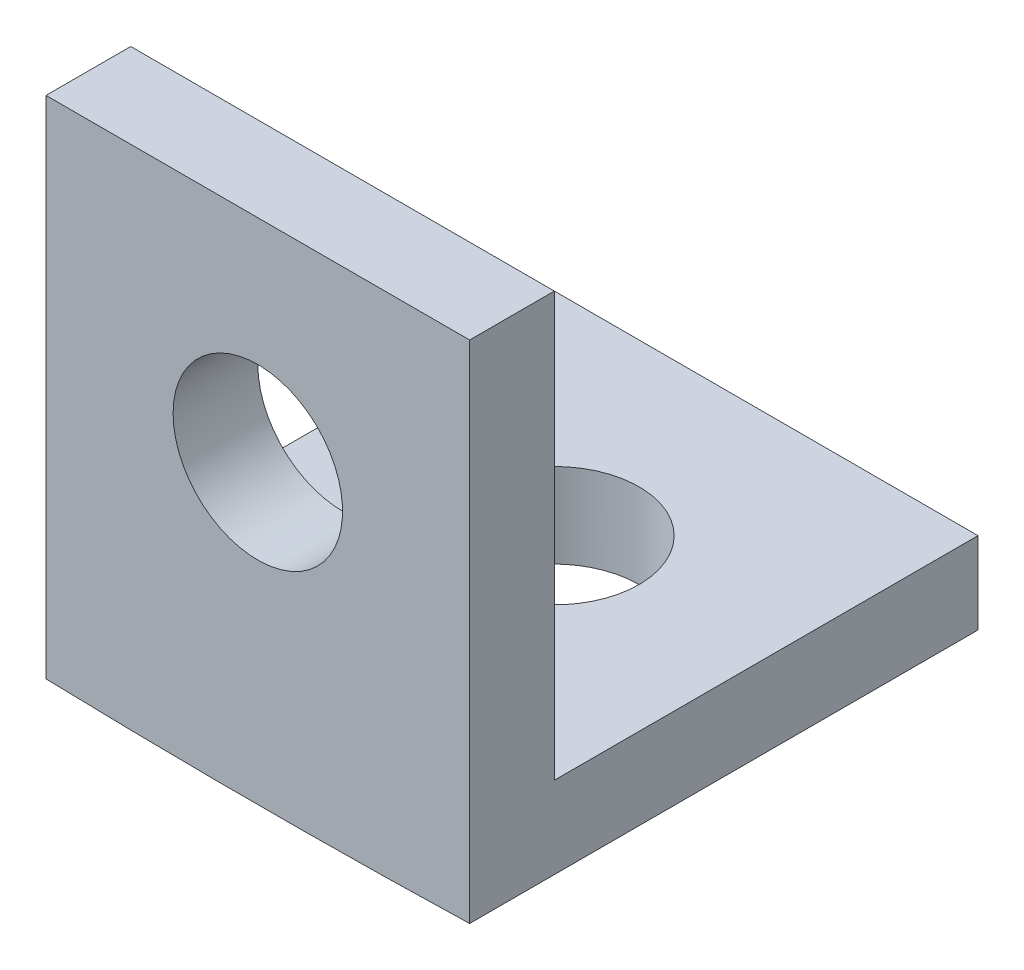
ISO-10303-21;
HEADER;
FILE_DESCRIPTION(('STEP AP214'),'2;1');
FILE_NAME('part.step','',(''),(''),'','','');
FILE_SCHEMA(('AUTOMOTIVE_DESIGN { 1 0 10303 214 1 1 1 1 }'));
ENDSEC;
DATA;
#1=APPLICATION_CONTEXT('core data for automotive mechanical design processes');
#2=APPLICATION_PROTOCOL_DEFINITION('international standard','automotive_design',2000,#1);
#3=PRODUCT_CONTEXT('',#1,'mechanical');
#4=PRODUCT('Part','Part','',(#3));
#5=PRODUCT_RELATED_PRODUCT_CATEGORY('part','',(#4));
#6=PRODUCT_DEFINITION_FORMATION('','',#4);
#7=PRODUCT_DEFINITION_CONTEXT('part definition',#1,'design');
#8=PRODUCT_DEFINITION('design','',#6,#7);
#9=PRODUCT_DEFINITION_SHAPE('','',#8);
#10=(LENGTH_UNIT() NAMED_UNIT(*) SI_UNIT(.MILLI.,.METRE.));
#11=(NAMED_UNIT(*) PLANE_ANGLE_UNIT() SI_UNIT($,.RADIAN.));
#12=(NAMED_UNIT(*) SI_UNIT($,.STERADIAN.) SOLID_ANGLE_UNIT());
#13=UNCERTAINTY_MEASURE_WITH_UNIT(LENGTH_MEASURE(1.E-05),#10,'distance_accuracy_value','');
#14=(GEOMETRIC_REPRESENTATION_CONTEXT(3) GLOBAL_UNCERTAINTY_ASSIGNED_CONTEXT((#13)) GLOBAL_UNIT_ASSIGNED_CONTEXT((#10,
#11,#12)) REPRESENTATION_CONTEXT('',''));
#15=CARTESIAN_POINT('',(0.,0.,0.));
#16=DIRECTION('',(0.,0.,1.));
#17=DIRECTION('',(1.,0.,0.));
#18=AXIS2_PLACEMENT_3D('',#15,#16,#17);
#19=CARTESIAN_POINT('',(0.,0.,0.));
#20=DIRECTION('',(0.,0.,-1.));
#21=DIRECTION('',(-1.,0.,0.));
#22=AXIS2_PLACEMENT_3D('',#19,#20,#21);
#23=PLANE('',#22);
#24=CARTESIAN_POINT('',(0.,0.499999999999999,0.));
#25=DIRECTION('',(0.,0.,-1.));
#26=DIRECTION('',(-1.,0.,0.));
#27=AXIS2_PLACEMENT_3D('',#24,#25,#26);
#28=CIRCLE('',#27,1.);
#29=CARTESIAN_POINT('',(-1.,0.499999999999999,0.));
#30=VERTEX_POINT('',#29);
#31=EDGE_CURVE('E210',#30,#30,#28,.F.);
#32=ORIENTED_EDGE('',*,*,#31,.F.);
#33=EDGE_LOOP('',(#32));
#34=FACE_BOUND('',#33,.T.);
#35=CARTESIAN_POINT('',(0.,85.,0.));
#36=DIRECTION('',(0.,0.,1.));
#37=DIRECTION('',(1.,0.,0.));
#38=AXIS2_PLACEMENT_3D('',#35,#36,#37);
#39=CIRCLE('',#38,88.);
#40=CARTESIAN_POINT('',(-2.5,-2.9644814683745,0.));
#41=VERTEX_POINT('',#40);
#42=CARTESIAN_POINT('',(2.5,-2.9644814683745,0.));
#43=VERTEX_POINT('',#42);
#44=EDGE_CURVE('E113',#41,#43,#39,.T.);
#45=ORIENTED_EDGE('',*,*,#44,.T.);
#46=DIRECTION('',(0.,1.,0.));
#47=VECTOR('',#46,1.);
#48=CARTESIAN_POINT('',(2.5,3.,0.));
#49=LINE('',#48,#47);
#50=CARTESIAN_POINT('',(2.5,3.,0.));
#51=VERTEX_POINT('',#50);
#52=EDGE_CURVE('E121',#43,#51,#49,.T.);
#53=ORIENTED_EDGE('',*,*,#52,.T.);
#54=DIRECTION('',(-1.,0.,0.));
#55=VECTOR('',#54,1.);
#56=CARTESIAN_POINT('',(2.5,3.,0.));
#57=LINE('',#56,#55);
#58=CARTESIAN_POINT('',(-2.5,3.,0.));
#59=VERTEX_POINT('',#58);
#60=EDGE_CURVE('E157',#51,#59,#57,.T.);
#61=ORIENTED_EDGE('',*,*,#60,.T.);
#62=DIRECTION('',(0.,-1.,0.));
#63=VECTOR('',#62,1.);
#64=CARTESIAN_POINT('',(-2.5,3.,0.));
#65=LINE('',#64,#63);
#66=EDGE_CURVE('E149',#59,#41,#65,.T.);
#67=ORIENTED_EDGE('',*,*,#66,.T.);
#68=EDGE_LOOP('',(#45,#53,#61,#67));
#69=FACE_BOUND('',#68,.T.);
#70=ADVANCED_FACE('F52',(#34,#69),#23,.F.);
#71=CARTESIAN_POINT('',(0.,0.,-6.));
#72=DIRECTION('',(0.,0.,1.));
#73=DIRECTION('',(1.,0.,0.));
#74=AXIS2_PLACEMENT_3D('',#71,#72,#73);
#75=PLANE('',#74);
#76=DIRECTION('',(0.,-1.,0.));
#77=VECTOR('',#76,1.);
#78=CARTESIAN_POINT('',(2.5,-3.,-6.));
#79=LINE('',#78,#77);
#80=CARTESIAN_POINT('',(2.5,-2.,-6.));
#81=VERTEX_POINT('',#80);
#82=CARTESIAN_POINT('',(2.5,-2.9644814683745,-6.));
#83=VERTEX_POINT('',#82);
#84=EDGE_CURVE('E119',#81,#83,#79,.T.);
#85=ORIENTED_EDGE('',*,*,#84,.T.);
#86=CARTESIAN_POINT('',(0.,85.,-6.));
#87=DIRECTION('',(0.,0.,1.));
#88=DIRECTION('',(1.,0.,0.));
#89=AXIS2_PLACEMENT_3D('',#86,#87,#88);
#90=CIRCLE('',#89,88.);
#91=CARTESIAN_POINT('',(-2.5,-2.9644814683745,-6.));
#92=VERTEX_POINT('',#91);
#93=EDGE_CURVE('E105',#83,#92,#90,.F.);
#94=ORIENTED_EDGE('',*,*,#93,.T.);
#95=DIRECTION('',(0.,1.,0.));
#96=VECTOR('',#95,1.);
#97=CARTESIAN_POINT('',(-2.5,-2.,-6.));
#98=LINE('',#97,#96);
#99=CARTESIAN_POINT('',(-2.5,-2.,-6.));
#100=VERTEX_POINT('',#99);
#101=EDGE_CURVE('E128',#92,#100,#98,.T.);
#102=ORIENTED_EDGE('',*,*,#101,.T.);
#103=DIRECTION('',(1.,0.,0.));
#104=VECTOR('',#103,1.);
#105=CARTESIAN_POINT('',(2.5,-2.,-6.));
#106=LINE('',#105,#104);
#107=EDGE_CURVE('E126',#100,#81,#106,.T.);
#108=ORIENTED_EDGE('',*,*,#107,.T.);
#109=EDGE_LOOP('',(#85,#94,#102,#108));
#110=FACE_BOUND('',#109,.T.);
#111=ADVANCED_FACE('F124',(#110),#75,.F.);
#112=CARTESIAN_POINT('',(2.5,3.,-1.));
#113=DIRECTION('',(1.,0.,0.));
#114=DIRECTION('',(0.,1.,0.));
#115=AXIS2_PLACEMENT_3D('',#112,#113,#114);
#116=PLANE('',#115);
#117=ORIENTED_EDGE('',*,*,#52,.F.);
#118=DIRECTION('',(0.,0.,1.));
#119=VECTOR('',#118,1.);
#120=CARTESIAN_POINT('',(2.5,-2.9644814683745,-6.001025));
#121=LINE('',#120,#119);
#122=EDGE_CURVE('E108',#83,#43,#121,.T.);
#123=ORIENTED_EDGE('',*,*,#122,.F.);
#124=ORIENTED_EDGE('',*,*,#84,.F.);
#125=DIRECTION('',(0.,0.,1.));
#126=VECTOR('',#125,1.);
#127=CARTESIAN_POINT('',(2.5,-2.,-6.));
#128=LINE('',#127,#126);
#129=CARTESIAN_POINT('',(2.5,-2.,-1.));
#130=VERTEX_POINT('',#129);
#131=EDGE_CURVE('E136',#81,#130,#128,.T.);
#132=ORIENTED_EDGE('',*,*,#131,.T.);
#133=DIRECTION('',(0.,1.,0.));
#134=VECTOR('',#133,1.);
#135=CARTESIAN_POINT('',(2.5,3.,-1.));
#136=LINE('',#135,#134);
#137=CARTESIAN_POINT('',(2.5,3.,-1.));
#138=VERTEX_POINT('',#137);
#139=EDGE_CURVE('E143',#130,#138,#136,.T.);
#140=ORIENTED_EDGE('',*,*,#139,.T.);
#141=DIRECTION('',(0.,0.,1.));
#142=VECTOR('',#141,1.);
#143=CARTESIAN_POINT('',(2.5,3.,-1.));
#144=LINE('',#143,#142);
#145=EDGE_CURVE('E61',#138,#51,#144,.T.);
#146=ORIENTED_EDGE('',*,*,#145,.T.);
#147=EDGE_LOOP('',(#117,#123,#124,#132,#140,#146));
#148=FACE_BOUND('',#147,.T.);
#149=ADVANCED_FACE('F117',(#148),#116,.T.);
#150=CARTESIAN_POINT('',(-2.5,3.,-1.));
#151=DIRECTION('',(-1.,0.,0.));
#152=DIRECTION('',(0.,-1.,0.));
#153=AXIS2_PLACEMENT_3D('',#150,#151,#152);
#154=PLANE('',#153);
#155=ORIENTED_EDGE('',*,*,#101,.F.);
#156=DIRECTION('',(0.,0.,1.));
#157=VECTOR('',#156,1.);
#158=CARTESIAN_POINT('',(-2.5,-2.9644814683745,-6.001025));
#159=LINE('',#158,#157);
#160=EDGE_CURVE('E69',#92,#41,#159,.T.);
#161=ORIENTED_EDGE('',*,*,#160,.T.);
#162=ORIENTED_EDGE('',*,*,#66,.F.);
#163=DIRECTION('',(0.,0.,1.));
#164=VECTOR('',#163,1.);
#165=CARTESIAN_POINT('',(-2.5,3.,-1.));
#166=LINE('',#165,#164);
#167=CARTESIAN_POINT('',(-2.5,3.,-1.));
#168=VERTEX_POINT('',#167);
#169=EDGE_CURVE('E12',#168,#59,#166,.T.);
#170=ORIENTED_EDGE('',*,*,#169,.F.);
#171=DIRECTION('',(0.,-1.,0.));
#172=VECTOR('',#171,1.);
#173=CARTESIAN_POINT('',(-2.5,3.,-1.));
#174=LINE('',#173,#172);
#175=CARTESIAN_POINT('',(-2.5,-2.,-1.));
#176=VERTEX_POINT('',#175);
#177=EDGE_CURVE('E162',#168,#176,#174,.T.);
#178=ORIENTED_EDGE('',*,*,#177,.T.);
#179=DIRECTION('',(0.,0.,1.));
#180=VECTOR('',#179,1.);
#181=CARTESIAN_POINT('',(-2.5,-2.,-6.));
#182=LINE('',#181,#180);
#183=EDGE_CURVE('E146',#100,#176,#182,.T.);
#184=ORIENTED_EDGE('',*,*,#183,.F.);
#185=EDGE_LOOP('',(#155,#161,#162,#170,#178,#184));
#186=FACE_BOUND('',#185,.T.);
#187=ADVANCED_FACE('F54',(#186),#154,.T.);
#188=CARTESIAN_POINT('',(2.5,3.,-1.));
#189=DIRECTION('',(0.,1.,0.));
#190=DIRECTION('',(-1.,0.,0.));
#191=AXIS2_PLACEMENT_3D('',#188,#189,#190);
#192=PLANE('',#191);
#193=ORIENTED_EDGE('',*,*,#60,.F.);
#194=ORIENTED_EDGE('',*,*,#145,.F.);
#195=DIRECTION('',(-1.,0.,0.));
#196=VECTOR('',#195,1.);
#197=CARTESIAN_POINT('',(2.5,3.,-1.));
#198=LINE('',#197,#196);
#199=EDGE_CURVE('E160',#138,#168,#198,.T.);
#200=ORIENTED_EDGE('',*,*,#199,.T.);
#201=ORIENTED_EDGE('',*,*,#169,.T.);
#202=EDGE_LOOP('',(#193,#194,#200,#201));
#203=FACE_BOUND('',#202,.T.);
#204=ADVANCED_FACE('F170',(#203),#192,.T.);
#205=CARTESIAN_POINT('',(0.,0.,-1.));
#206=DIRECTION('',(0.,0.,-1.));
#207=DIRECTION('',(-1.,0.,0.));
#208=AXIS2_PLACEMENT_3D('',#205,#206,#207);
#209=PLANE('',#208);
#210=CARTESIAN_POINT('',(0.,0.499999999999999,-1.));
#211=DIRECTION('',(0.,0.,-1.));
#212=DIRECTION('',(-1.,0.,0.));
#213=AXIS2_PLACEMENT_3D('',#210,#211,#212);
#214=CIRCLE('',#213,1.);
#215=CARTESIAN_POINT('',(-1.,0.499999999999999,-1.));
#216=VERTEX_POINT('',#215);
#217=EDGE_CURVE('E225',#216,#216,#214,.T.);
#218=ORIENTED_EDGE('',*,*,#217,.F.);
#219=EDGE_LOOP('',(#218));
#220=FACE_BOUND('',#219,.T.);
#221=DIRECTION('',(1.,0.,0.));
#222=VECTOR('',#221,1.);
#223=CARTESIAN_POINT('',(2.5,-2.,-1.));
#224=LINE('',#223,#222);
#225=EDGE_CURVE('E77',#176,#130,#224,.T.);
#226=ORIENTED_EDGE('',*,*,#225,.F.);
#227=ORIENTED_EDGE('',*,*,#177,.F.);
#228=ORIENTED_EDGE('',*,*,#199,.F.);
#229=ORIENTED_EDGE('',*,*,#139,.F.);
#230=EDGE_LOOP('',(#226,#227,#228,#229));
#231=FACE_BOUND('',#230,.T.);
#232=ADVANCED_FACE('F171',(#220,#231),#209,.T.);
#233=CARTESIAN_POINT('',(2.5,-2.,-6.));
#234=DIRECTION('',(0.,-1.,0.));
#235=DIRECTION('',(0.,0.,-1.));
#236=AXIS2_PLACEMENT_3D('',#233,#234,#235);
#237=PLANE('',#236);
#238=CARTESIAN_POINT('',(0.,-2.,-3.5));
#239=DIRECTION('',(0.,1.,0.));
#240=DIRECTION('',(0.,0.,1.));
#241=AXIS2_PLACEMENT_3D('',#238,#239,#240);
#242=CIRCLE('',#241,1.);
#243=CARTESIAN_POINT('',(0.,-2.,-2.5));
#244=VERTEX_POINT('',#243);
#245=EDGE_CURVE('E122',#244,#244,#242,.T.);
#246=ORIENTED_EDGE('',*,*,#245,.F.);
#247=EDGE_LOOP('',(#246));
#248=FACE_BOUND('',#247,.T.);
#249=ORIENTED_EDGE('',*,*,#225,.T.);
#250=ORIENTED_EDGE('',*,*,#131,.F.);
#251=ORIENTED_EDGE('',*,*,#107,.F.);
#252=ORIENTED_EDGE('',*,*,#183,.T.);
#253=EDGE_LOOP('',(#249,#250,#251,#252));
#254=FACE_BOUND('',#253,.T.);
#255=ADVANCED_FACE('F172',(#248,#254),#237,.F.);
#256=CARTESIAN_POINT('',(0.,85.,-6.001025));
#257=DIRECTION('',(0.,0.,1.));
#258=DIRECTION('',(1.,0.,0.));
#259=AXIS2_PLACEMENT_3D('',#256,#257,#258);
#260=CYLINDRICAL_SURFACE('',#259,88.);
#261=CARTESIAN_POINT('',(0.,-3.,-2.5));
#262=CARTESIAN_POINT('',(0.0561684934677506,-2.99999992320074,-2.50000249018827));
#263=CARTESIAN_POINT('',(0.112377668228196,-2.99994564594884,-2.50474822941597));
#264=CARTESIAN_POINT('',(0.223247854299943,-2.99973434106315,-2.52361399417022));
#265=CARTESIAN_POINT('',(0.27790692169938,-2.99957718989158,-2.53774529078929));
#266=CARTESIAN_POINT('',(0.384054626800077,-2.99917793896893,-2.57497971324262));
#267=CARTESIAN_POINT('',(0.435544770409773,-2.99893587993919,-2.59807853886543));
#268=CARTESIAN_POINT('',(0.53390186987023,-2.99839413733688,-2.65258638414503));
#269=CARTESIAN_POINT('',(0.580769968349062,-2.99809446806061,-2.68399334282072));
#270=CARTESIAN_POINT('',(0.668576038156351,-2.99747119925131,-2.75423376842586));
#271=CARTESIAN_POINT('',(0.709513148796691,-2.99714759625536,-2.79306831133186));
#272=CARTESIAN_POINT('',(0.784288223080198,-2.99651296419116,-2.8770604688172));
#273=CARTESIAN_POINT('',(0.818125907370084,-2.99620193561809,-2.92221833209452));
#274=CARTESIAN_POINT('',(0.877739966248439,-2.9956275308056,-3.01757464156769));
#275=CARTESIAN_POINT('',(0.90351627301746,-2.9953641549671,-3.06777313016505));
#276=CARTESIAN_POINT('',(0.946275252713056,-2.99491475644024,-3.17178534589273));
#277=CARTESIAN_POINT('',(0.963257945842042,-2.99472873357417,-3.22559906471711));
#278=CARTESIAN_POINT('',(0.987947002994795,-2.99445502283598,-3.33531182400786));
#279=CARTESIAN_POINT('',(0.99565375550953,-2.99436733084562,-3.39121077704025));
#280=CARTESIAN_POINT('',(1.00157334568267,-2.99430015632881,-3.50350909062978));
#281=CARTESIAN_POINT('',(0.999786203430504,-2.99432067357338,-3.5599084501278));
#282=CARTESIAN_POINT('',(0.986769109742719,-2.9944675999635,-3.67160394200211));
#283=CARTESIAN_POINT('',(0.975539591221012,-2.99459400425433,-3.72690012483785));
#284=CARTESIAN_POINT('',(0.943957171981541,-2.99493844634471,-3.83482238321656));
#285=CARTESIAN_POINT('',(0.923604260130117,-2.99515648425607,-3.887448455501));
#286=CARTESIAN_POINT('',(0.874352314868669,-2.99565961747772,-3.98853793390261));
#287=CARTESIAN_POINT('',(0.845453083482142,-2.9959447143414,-4.03700124355532));
#288=CARTESIAN_POINT('',(0.779929019278553,-2.9965498217132,-4.1283883994505));
#289=CARTESIAN_POINT('',(0.743304186605731,-2.99686983222065,-4.17131224579639));
#290=CARTESIAN_POINT('',(0.663366107694166,-2.99750871062572,-4.25040456255337));
#291=CARTESIAN_POINT('',(0.620052482541862,-2.99782757845755,-4.28657265000067));
#292=CARTESIAN_POINT('',(0.527967694527453,-2.99842820465458,-4.35112380326585));
#293=CARTESIAN_POINT('',(0.4791965309313,-2.99870996301479,-4.37950686803662));
#294=CARTESIAN_POINT('',(0.377580929768467,-2.99920460526306,-4.42768221527394));
#295=CARTESIAN_POINT('',(0.324736486949692,-2.99941748906231,-4.44747448666329));
#296=CARTESIAN_POINT('',(0.216474514931405,-2.99975038014042,-4.47790616438804));
#297=CARTESIAN_POINT('',(0.161056986835847,-2.99987038745912,-4.48854557465034));
#298=CARTESIAN_POINT('',(0.0492253000079198,-3.00000399135953,-4.50036904389153));
#299=CARTESIAN_POINT('',(-0.00718880279748872,-3.00001759389368,-4.50155363178856));
#300=CARTESIAN_POINT('',(-0.119415132884653,-2.99993687042852,-4.49443520672477));
#301=CARTESIAN_POINT('',(-0.175227360243139,-2.99984254444297,-4.48613219497346));
#302=CARTESIAN_POINT('',(-0.28466412871002,-2.99955660174248,-4.46027470451865));
#303=CARTESIAN_POINT('',(-0.338288726336048,-2.99936498754272,-4.44272046498483));
#304=CARTESIAN_POINT('',(-0.441829723075527,-2.99890606989018,-4.39885907575939));
#305=CARTESIAN_POINT('',(-0.491746121530747,-2.99863876642396,-4.37255192451406));
#306=CARTESIAN_POINT('',(-0.58645618394522,-2.9980585883525,-4.31193012895892));
#307=CARTESIAN_POINT('',(-0.63124962019593,-2.997745711723,-4.27761512891732));
#308=CARTESIAN_POINT('',(-0.714439938814126,-2.99710966653218,-4.20195224392222));
#309=CARTESIAN_POINT('',(-0.752836816624442,-2.99678649796352,-4.16060435395825));
#310=CARTESIAN_POINT('',(-0.82214579796288,-2.9961662864139,-4.07204716360628));
#311=CARTESIAN_POINT('',(-0.853057558632267,-2.99586924463007,-4.02483759487157));
#312=CARTESIAN_POINT('',(-0.906516447001361,-2.99533479501048,-3.92589860339714));
#313=CARTESIAN_POINT('',(-0.929063584973357,-2.99509738710147,-3.87416918620817));
#314=CARTESIAN_POINT('',(-0.965152618501333,-2.99470897955824,-3.76766021051338));
#315=CARTESIAN_POINT('',(-0.978694738964117,-2.99455797776597,-3.71288072822216));
#316=CARTESIAN_POINT('',(-0.996390071372318,-2.99435940056458,-3.60182547123741));
#317=CARTESIAN_POINT('',(-1.00054327000559,-2.9943118253021,-3.54554969442247));
#318=CARTESIAN_POINT('',(-0.999342799192371,-2.99432546617258,-3.43310293481907));
#319=CARTESIAN_POINT('',(-0.99398968285153,-2.99438667597609,-3.37693194612408));
#320=CARTESIAN_POINT('',(-0.973929649134382,-2.99461097304428,-3.26628590354309));
#321=CARTESIAN_POINT('',(-0.959222712981029,-2.99477406051347,-3.21181085306177));
#322=CARTESIAN_POINT('',(-0.920872305349153,-2.99518372890689,-3.10610211286432));
#323=CARTESIAN_POINT('',(-0.897228668574815,-2.99543031137546,-3.05486848312292));
#324=CARTESIAN_POINT('',(-0.841677073765759,-2.99597915745317,-2.95709972626319));
#325=CARTESIAN_POINT('',(-0.809769436547475,-2.99628141890068,-2.91056441684901));
#326=CARTESIAN_POINT('',(-0.738597269703974,-2.99690754176143,-2.82351278022704));
#327=CARTESIAN_POINT('',(-0.699333095362943,-2.99723140213107,-2.78299616251569));
#328=CARTESIAN_POINT('',(-0.614548480686488,-2.99786431136394,-2.7091194904419));
#329=CARTESIAN_POINT('',(-0.569026488631701,-2.9981733565278,-2.67576121636826));
#330=CARTESIAN_POINT('',(-0.473009114690996,-2.99874184882604,-2.61714716229411));
#331=CARTESIAN_POINT('',(-0.422511248361043,-2.99900127099169,-2.59189545695347));
#332=CARTESIAN_POINT('',(-0.318032061114782,-2.99944075516528,-2.5502575042528));
#333=CARTESIAN_POINT('',(-0.264055000357704,-2.99962091219122,-2.53386063688283));
#334=CARTESIAN_POINT('',(-0.174778643700035,-2.99983317797445,-2.51476438026512));
#335=CARTESIAN_POINT('',(-0.140059358781614,-2.99989546646629,-2.5092346556246));
#336=CARTESIAN_POINT('',(-0.0702320185725491,-2.99997890149074,-2.50185168697081));
#337=CARTESIAN_POINT('',(-0.0351239632980077,-3.00000004802505,-2.49999844280528));
#338=CARTESIAN_POINT('',(0.,-3.,-2.5));
#339=B_SPLINE_CURVE_WITH_KNOTS('',3,(#261,#262,#263,#264,#265,#266,#267,#268,#269,#270,#271,
#272,#273,#274,#275,#276,#277,#278,#279,#280,#281,#282,#283,#284,#285,#286,#287,#288,#289,#290,
#291,#292,#293,#294,#295,#296,#297,#298,#299,#300,#301,#302,#303,#304,#305,#306,#307,#308,#309,
#310,#311,#312,#313,#314,#315,#316,#317,#318,#319,#320,#321,#322,#323,#324,#325,#326,#327,#328,
#329,#330,#331,#332,#333,#334,#335,#336,#337,#338),.UNSPECIFIED.,.T.,.F.,(4,2,2,2,2,2,2,2,2,2,2,
2,2,2,2,2,2,2,2,2,2,2,2,2,2,2,2,2,2,2,2,2,2,2,2,2,2,2,4),(0.,0.16837727736687,0.33695712508232,
0.50545623312631,0.673913581085029,0.842395350662301,1.01088374853736,1.17937356384793,
1.34786299206898,1.51634536344248,1.68482737830129,1.85330166902066,2.02177616533686,
2.19025456469048,2.35873296089857,2.52722090474671,2.6957088712568,2.86419705501929,
3.03268516649442,3.20116385240419,3.3696425168354,3.53811682584338,3.7065911647567,
3.87507298921206,4.04355493370025,4.21204459411092,4.38053404760484,4.54901929279511,
4.71750477687316,4.88598045828632,5.05445647790201,5.22293561385171,5.39140821025963,
5.55987267237463,5.72837898337392,5.89696985971742,6.06535808574484,6.17064981052264,
6.27594153093968),.UNSPECIFIED.);
#340=CARTESIAN_POINT('',(0.,-3.,-2.5));
#341=VERTEX_POINT('',#340);
#342=EDGE_CURVE('E203',#341,#341,#339,.T.);
#343=ORIENTED_EDGE('',*,*,#342,.T.);
#344=EDGE_LOOP('',(#343));
#345=FACE_BOUND('',#344,.T.);
#346=ORIENTED_EDGE('',*,*,#93,.F.);
#347=ORIENTED_EDGE('',*,*,#122,.T.);
#348=ORIENTED_EDGE('',*,*,#44,.F.);
#349=ORIENTED_EDGE('',*,*,#160,.F.);
#350=EDGE_LOOP('',(#346,#347,#348,#349));
#351=FACE_BOUND('',#350,.T.);
#352=ADVANCED_FACE('F107',(#345,#351),#260,.T.);
#353=CARTESIAN_POINT('',(0.,-3.001,-3.5));
#354=DIRECTION('',(0.,1.,0.));
#355=DIRECTION('',(0.,0.,1.));
#356=AXIS2_PLACEMENT_3D('',#353,#354,#355);
#357=CYLINDRICAL_SURFACE('',#356,1.);
#358=ORIENTED_EDGE('',*,*,#342,.F.);
#359=EDGE_LOOP('',(#358));
#360=FACE_BOUND('',#359,.T.);
#361=ORIENTED_EDGE('',*,*,#245,.T.);
#362=EDGE_LOOP('',(#361));
#363=FACE_BOUND('',#362,.T.);
#364=ADVANCED_FACE('F180',(#360,#363),#357,.F.);
#365=CARTESIAN_POINT('',(0.,0.499999999999999,0.000999999999999916));
#366=DIRECTION('',(0.,0.,-1.));
#367=DIRECTION('',(-1.,0.,0.));
#368=AXIS2_PLACEMENT_3D('',#365,#366,#367);
#369=CYLINDRICAL_SURFACE('',#368,1.);
#370=ORIENTED_EDGE('',*,*,#217,.T.);
#371=EDGE_LOOP('',(#370));
#372=FACE_BOUND('',#371,.T.);
#373=ORIENTED_EDGE('',*,*,#31,.T.);
#374=EDGE_LOOP('',(#373));
#375=FACE_BOUND('',#374,.T.);
#376=ADVANCED_FACE('F215',(#372,#375),#369,.F.);
#377=CLOSED_SHELL('',(#70,#111,#149,#187,#204,#232,#255,#352,#364,#376));
#378=MANIFOLD_SOLID_BREP('B2',#377);
#379=ADVANCED_BREP_SHAPE_REPRESENTATION('',(#18,#378),#14);
#380=SHAPE_DEFINITION_REPRESENTATION(#9,#379);
ENDSEC;
END-ISO-10303-21;
